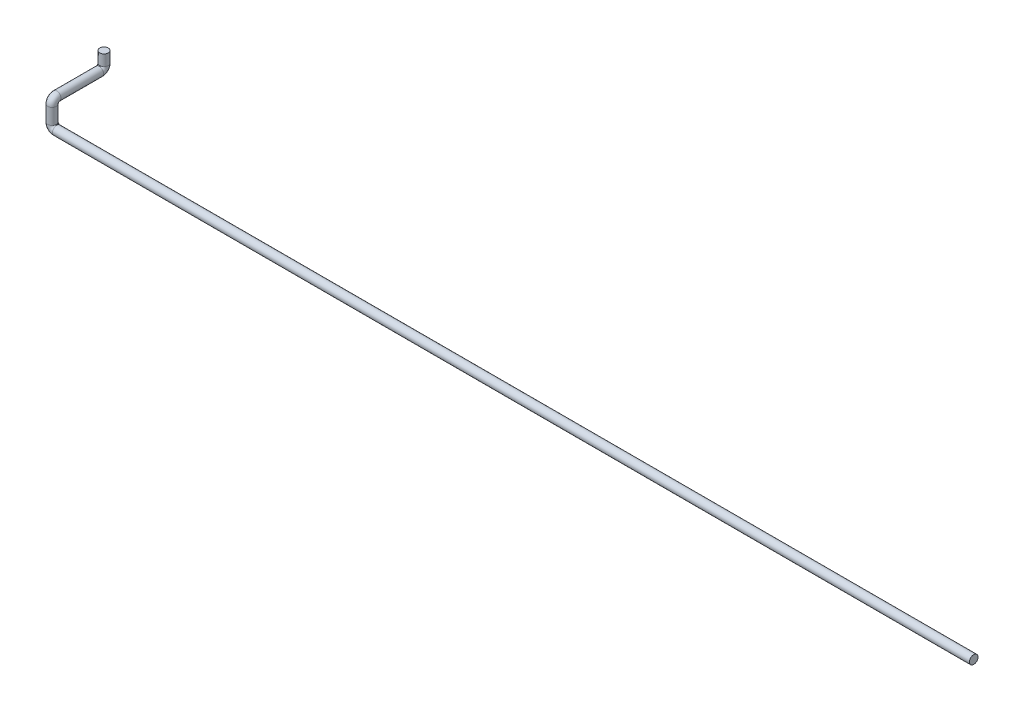
ISO-10303-21;
HEADER;
FILE_DESCRIPTION(('STEP AP214'),'2;1');
FILE_NAME('part.step','',(''),(''),'','','');
FILE_SCHEMA(('AUTOMOTIVE_DESIGN { 1 0 10303 214 1 1 1 1 }'));
ENDSEC;
DATA;
#1=APPLICATION_CONTEXT('core data for automotive mechanical design processes');
#2=APPLICATION_PROTOCOL_DEFINITION('international standard','automotive_design',2000,#1);
#3=PRODUCT_CONTEXT('',#1,'mechanical');
#4=PRODUCT('Part','Part','',(#3));
#5=PRODUCT_RELATED_PRODUCT_CATEGORY('part','',(#4));
#6=PRODUCT_DEFINITION_FORMATION('','',#4);
#7=PRODUCT_DEFINITION_CONTEXT('part definition',#1,'design');
#8=PRODUCT_DEFINITION('design','',#6,#7);
#9=PRODUCT_DEFINITION_SHAPE('','',#8);
#10=(LENGTH_UNIT() NAMED_UNIT(*) SI_UNIT(.MILLI.,.METRE.));
#11=(NAMED_UNIT(*) PLANE_ANGLE_UNIT() SI_UNIT($,.RADIAN.));
#12=(NAMED_UNIT(*) SI_UNIT($,.STERADIAN.) SOLID_ANGLE_UNIT());
#13=UNCERTAINTY_MEASURE_WITH_UNIT(LENGTH_MEASURE(1.E-05),#10,'distance_accuracy_value','');
#14=(GEOMETRIC_REPRESENTATION_CONTEXT(3) GLOBAL_UNCERTAINTY_ASSIGNED_CONTEXT((#13)) GLOBAL_UNIT_ASSIGNED_CONTEXT((#10,
#11,#12)) REPRESENTATION_CONTEXT('',''));
#15=CARTESIAN_POINT('',(0.,0.,0.));
#16=DIRECTION('',(0.,0.,1.));
#17=DIRECTION('',(1.,0.,0.));
#18=AXIS2_PLACEMENT_3D('',#15,#16,#17);
#19=CARTESIAN_POINT('',(0.,0.,0.));
#20=DIRECTION('',(1.,0.,0.));
#21=DIRECTION('',(0.,0.,-1.));
#22=AXIS2_PLACEMENT_3D('',#19,#20,#21);
#23=PLANE('',#22);
#24=CARTESIAN_POINT('',(0.,0.,0.));
#25=DIRECTION('',(1.,0.,0.));
#26=DIRECTION('',(0.,0.,-1.));
#27=AXIS2_PLACEMENT_3D('',#24,#25,#26);
#28=CIRCLE('',#27,13.7);
#29=CARTESIAN_POINT('',(0.,0.,-13.7));
#30=VERTEX_POINT('',#29);
#31=EDGE_CURVE('E47',#30,#30,#28,.T.);
#32=ORIENTED_EDGE('',*,*,#31,.T.);
#33=EDGE_LOOP('',(#32));
#34=FACE_BOUND('',#33,.T.);
#35=ADVANCED_FACE('F35',(#34),#23,.T.);
#36=CARTESIAN_POINT('',(-2945.,130.,-166.));
#37=DIRECTION('',(0.,-1.,0.));
#38=DIRECTION('',(0.,0.,-1.));
#39=AXIS2_PLACEMENT_3D('',#36,#37,#38);
#40=PLANE('',#39);
#41=CARTESIAN_POINT('',(-2945.,130.,-166.));
#42=DIRECTION('',(0.,-1.,0.));
#43=DIRECTION('',(0.,0.,-1.));
#44=AXIS2_PLACEMENT_3D('',#41,#42,#43);
#45=CIRCLE('',#44,13.7);
#46=CARTESIAN_POINT('',(-2945.,130.,-179.7));
#47=VERTEX_POINT('',#46);
#48=EDGE_CURVE('E11',#47,#47,#45,.T.);
#49=ORIENTED_EDGE('',*,*,#48,.F.);
#50=EDGE_LOOP('',(#49));
#51=FACE_BOUND('',#50,.T.);
#52=ADVANCED_FACE('F53',(#51),#40,.F.);
#53=CARTESIAN_POINT('',(0.,0.,0.));
#54=DIRECTION('',(-1.,0.,0.));
#55=DIRECTION('',(0.,0.,1.));
#56=AXIS2_PLACEMENT_3D('',#53,#54,#55);
#57=CYLINDRICAL_SURFACE('',#56,13.7);
#58=CARTESIAN_POINT('',(-2930.,0.,0.));
#59=DIRECTION('',(1.,0.,0.));
#60=DIRECTION('',(0.,0.,-1.));
#61=AXIS2_PLACEMENT_3D('',#58,#59,#60);
#62=CIRCLE('',#61,13.7);
#63=CARTESIAN_POINT('',(-2930.,-13.7000000000001,0.));
#64=VERTEX_POINT('',#63);
#65=EDGE_CURVE('E95',#64,#64,#62,.T.);
#66=ORIENTED_EDGE('',*,*,#65,.T.);
#67=EDGE_LOOP('',(#66));
#68=FACE_BOUND('',#67,.T.);
#69=ORIENTED_EDGE('',*,*,#31,.F.);
#70=EDGE_LOOP('',(#69));
#71=FACE_BOUND('',#70,.T.);
#72=ADVANCED_FACE('F55',(#68,#71),#57,.T.);
#73=CARTESIAN_POINT('',(-2930.,15.,0.));
#74=DIRECTION('',(0.,0.,-1.));
#75=DIRECTION('',(-1.,0.,0.));
#76=AXIS2_PLACEMENT_3D('',#73,#74,#75);
#77=TOROIDAL_SURFACE('',#76,15.0000000000001,13.7);
#78=CARTESIAN_POINT('',(-2945.,15.,0.));
#79=DIRECTION('',(0.,-1.,0.));
#80=DIRECTION('',(0.,0.,-1.));
#81=AXIS2_PLACEMENT_3D('',#78,#79,#80);
#82=CIRCLE('',#81,13.7);
#83=CARTESIAN_POINT('',(-2958.7,15.,0.));
#84=VERTEX_POINT('',#83);
#85=EDGE_CURVE('E92',#84,#84,#82,.T.);
#86=CARTESIAN_POINT('',(-2930.,15.,0.));
#87=DIRECTION('',(0.,0.,-1.));
#88=DIRECTION('',(-1.,0.,0.));
#89=AXIS2_PLACEMENT_3D('',#86,#87,#88);
#90=CIRCLE('',#89,28.7000000000001);
#91=EDGE_CURVE('',#64,#84,#90,.T.);
#92=ORIENTED_EDGE('',*,*,#65,.F.);
#93=ORIENTED_EDGE('',*,*,#85,.T.);
#94=ORIENTED_EDGE('',*,*,#91,.T.);
#95=ORIENTED_EDGE('',*,*,#91,.F.);
#96=EDGE_LOOP('',(#92,#94,#93,#95));
#97=FACE_BOUND('',#96,.T.);
#98=ADVANCED_FACE('F60',(#97),#77,.T.);
#99=CARTESIAN_POINT('',(-2945.,15.,0.));
#100=DIRECTION('',(0.,1.,0.));
#101=DIRECTION('',(0.,0.,1.));
#102=AXIS2_PLACEMENT_3D('',#99,#100,#101);
#103=CYLINDRICAL_SURFACE('',#102,13.7);
#104=CARTESIAN_POINT('',(-2945.,65.,0.));
#105=DIRECTION('',(0.,-1.,0.));
#106=DIRECTION('',(0.,0.,-1.));
#107=AXIS2_PLACEMENT_3D('',#104,#105,#106);
#108=CIRCLE('',#107,13.7);
#109=CARTESIAN_POINT('',(-2945.,65.,13.7));
#110=VERTEX_POINT('',#109);
#111=EDGE_CURVE('E97',#110,#110,#108,.T.);
#112=ORIENTED_EDGE('',*,*,#111,.T.);
#113=EDGE_LOOP('',(#112));
#114=FACE_BOUND('',#113,.T.);
#115=ORIENTED_EDGE('',*,*,#85,.F.);
#116=EDGE_LOOP('',(#115));
#117=FACE_BOUND('',#116,.T.);
#118=ADVANCED_FACE('F80',(#114,#117),#103,.T.);
#119=CARTESIAN_POINT('',(-2945.,65.,-15.));
#120=DIRECTION('',(-1.,0.,0.));
#121=DIRECTION('',(0.,0.,1.));
#122=AXIS2_PLACEMENT_3D('',#119,#120,#121);
#123=TOROIDAL_SURFACE('',#122,15.,13.7);
#124=CARTESIAN_POINT('',(-2945.,80.,-15.));
#125=DIRECTION('',(0.,0.,1.));
#126=DIRECTION('',(0.,-1.,0.));
#127=AXIS2_PLACEMENT_3D('',#124,#125,#126);
#128=CIRCLE('',#127,13.7);
#129=CARTESIAN_POINT('',(-2945.,93.7,-15.));
#130=VERTEX_POINT('',#129);
#131=EDGE_CURVE('E103',#130,#130,#128,.T.);
#132=CARTESIAN_POINT('',(-2945.,65.,-15.));
#133=DIRECTION('',(-1.,0.,0.));
#134=DIRECTION('',(0.,0.,1.));
#135=AXIS2_PLACEMENT_3D('',#132,#133,#134);
#136=CIRCLE('',#135,28.7);
#137=EDGE_CURVE('',#110,#130,#136,.T.);
#138=ORIENTED_EDGE('',*,*,#111,.F.);
#139=ORIENTED_EDGE('',*,*,#131,.T.);
#140=ORIENTED_EDGE('',*,*,#137,.T.);
#141=ORIENTED_EDGE('',*,*,#137,.F.);
#142=EDGE_LOOP('',(#138,#140,#139,#141));
#143=FACE_BOUND('',#142,.T.);
#144=ADVANCED_FACE('F76',(#143),#123,.T.);
#145=CARTESIAN_POINT('',(-2945.,80.,-15.));
#146=DIRECTION('',(0.,0.,-1.));
#147=DIRECTION('',(0.,1.,0.));
#148=AXIS2_PLACEMENT_3D('',#145,#146,#147);
#149=CYLINDRICAL_SURFACE('',#148,13.7);
#150=CARTESIAN_POINT('',(-2945.,80.0000000000001,-151.));
#151=DIRECTION('',(0.,0.,1.));
#152=DIRECTION('',(0.,-1.,0.));
#153=AXIS2_PLACEMENT_3D('',#150,#151,#152);
#154=CIRCLE('',#153,13.7);
#155=CARTESIAN_POINT('',(-2945.,66.3000000000001,-151.));
#156=VERTEX_POINT('',#155);
#157=EDGE_CURVE('E106',#156,#156,#154,.T.);
#158=ORIENTED_EDGE('',*,*,#157,.T.);
#159=EDGE_LOOP('',(#158));
#160=FACE_BOUND('',#159,.T.);
#161=ORIENTED_EDGE('',*,*,#131,.F.);
#162=EDGE_LOOP('',(#161));
#163=FACE_BOUND('',#162,.T.);
#164=ADVANCED_FACE('F70',(#160,#163),#149,.T.);
#165=CARTESIAN_POINT('',(-2945.,95.0000000000001,-151.));
#166=DIRECTION('',(1.,0.,0.));
#167=DIRECTION('',(0.,0.,-1.));
#168=AXIS2_PLACEMENT_3D('',#165,#166,#167);
#169=TOROIDAL_SURFACE('',#168,15.,13.7);
#170=CARTESIAN_POINT('',(-2945.,95.0000000000001,-166.));
#171=DIRECTION('',(0.,-1.,0.));
#172=DIRECTION('',(0.,0.,-1.));
#173=AXIS2_PLACEMENT_3D('',#170,#171,#172);
#174=CIRCLE('',#173,13.7);
#175=CARTESIAN_POINT('',(-2945.,95.0000000000001,-179.7));
#176=VERTEX_POINT('',#175);
#177=EDGE_CURVE('E42',#176,#176,#174,.T.);
#178=CARTESIAN_POINT('',(-2945.,95.0000000000001,-151.));
#179=DIRECTION('',(1.,0.,0.));
#180=DIRECTION('',(0.,0.,-1.));
#181=AXIS2_PLACEMENT_3D('',#178,#179,#180);
#182=CIRCLE('',#181,28.7);
#183=EDGE_CURVE('',#156,#176,#182,.T.);
#184=ORIENTED_EDGE('',*,*,#157,.F.);
#185=ORIENTED_EDGE('',*,*,#177,.T.);
#186=ORIENTED_EDGE('',*,*,#183,.T.);
#187=ORIENTED_EDGE('',*,*,#183,.F.);
#188=EDGE_LOOP('',(#184,#186,#185,#187));
#189=FACE_BOUND('',#188,.T.);
#190=ADVANCED_FACE('F66',(#189),#169,.T.);
#191=CARTESIAN_POINT('',(-2945.,95.0000000000001,-166.));
#192=DIRECTION('',(0.,1.,0.));
#193=DIRECTION('',(0.,0.,1.));
#194=AXIS2_PLACEMENT_3D('',#191,#192,#193);
#195=CYLINDRICAL_SURFACE('',#194,13.7);
#196=ORIENTED_EDGE('',*,*,#48,.T.);
#197=EDGE_LOOP('',(#196));
#198=FACE_BOUND('',#197,.T.);
#199=ORIENTED_EDGE('',*,*,#177,.F.);
#200=EDGE_LOOP('',(#199));
#201=FACE_BOUND('',#200,.T.);
#202=ADVANCED_FACE('F50',(#198,#201),#195,.T.);
#203=CLOSED_SHELL('',(#35,#52,#72,#98,#118,#144,#164,#190,#202));
#204=MANIFOLD_SOLID_BREP('B2',#203);
#205=ADVANCED_BREP_SHAPE_REPRESENTATION('',(#18,#204),#14);
#206=SHAPE_DEFINITION_REPRESENTATION(#9,#205);
ENDSEC;
END-ISO-10303-21;
